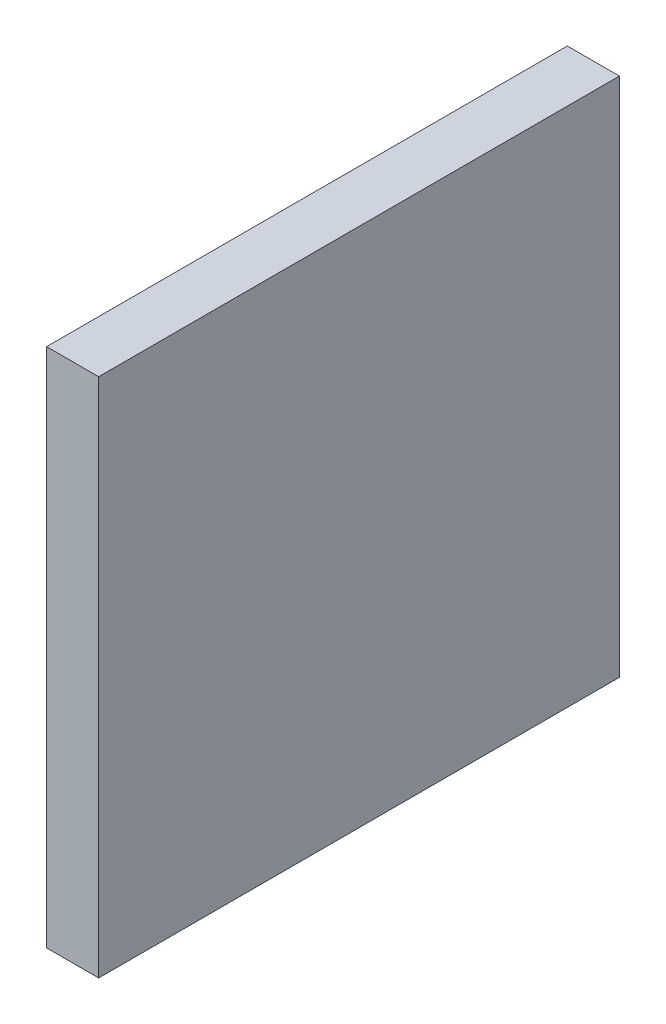
ISO-10303-21;
HEADER;
FILE_DESCRIPTION(('STEP AP214'),'2;1');
FILE_NAME('part.step','',(''),(''),'','','');
FILE_SCHEMA(('AUTOMOTIVE_DESIGN { 1 0 10303 214 1 1 1 1 }'));
ENDSEC;
DATA;
#1=APPLICATION_CONTEXT('core data for automotive mechanical design processes');
#2=APPLICATION_PROTOCOL_DEFINITION('international standard','automotive_design',2000,#1);
#3=PRODUCT_CONTEXT('',#1,'mechanical');
#4=PRODUCT('Part','Part','',(#3));
#5=PRODUCT_RELATED_PRODUCT_CATEGORY('part','',(#4));
#6=PRODUCT_DEFINITION_FORMATION('','',#4);
#7=PRODUCT_DEFINITION_CONTEXT('part definition',#1,'design');
#8=PRODUCT_DEFINITION('design','',#6,#7);
#9=PRODUCT_DEFINITION_SHAPE('','',#8);
#10=(LENGTH_UNIT() NAMED_UNIT(*) SI_UNIT(.MILLI.,.METRE.));
#11=(NAMED_UNIT(*) PLANE_ANGLE_UNIT() SI_UNIT($,.RADIAN.));
#12=(NAMED_UNIT(*) SI_UNIT($,.STERADIAN.) SOLID_ANGLE_UNIT());
#13=UNCERTAINTY_MEASURE_WITH_UNIT(LENGTH_MEASURE(1.E-05),#10,'distance_accuracy_value','');
#14=(GEOMETRIC_REPRESENTATION_CONTEXT(3) GLOBAL_UNCERTAINTY_ASSIGNED_CONTEXT((#13)) GLOBAL_UNIT_ASSIGNED_CONTEXT((#10,
#11,#12)) REPRESENTATION_CONTEXT('',''));
#15=CARTESIAN_POINT('',(0.,0.,0.));
#16=DIRECTION('',(0.,0.,1.));
#17=DIRECTION('',(1.,0.,0.));
#18=AXIS2_PLACEMENT_3D('',#15,#16,#17);
#19=CARTESIAN_POINT('',(5.,-25.,-25.));
#20=DIRECTION('',(0.,0.,1.));
#21=DIRECTION('',(1.,0.,0.));
#22=AXIS2_PLACEMENT_3D('',#19,#20,#21);
#23=PLANE('',#22);
#24=DIRECTION('',(0.,1.,0.));
#25=VECTOR('',#24,1.);
#26=CARTESIAN_POINT('',(0.,-25.,-25.));
#27=LINE('',#26,#25);
#28=CARTESIAN_POINT('',(0.,-25.,-25.));
#29=VERTEX_POINT('',#28);
#30=CARTESIAN_POINT('',(0.,25.,-25.));
#31=VERTEX_POINT('',#30);
#32=EDGE_CURVE('E113',#29,#31,#27,.T.);
#33=ORIENTED_EDGE('',*,*,#32,.T.);
#34=DIRECTION('',(-1.,0.,0.));
#35=VECTOR('',#34,1.);
#36=CARTESIAN_POINT('',(5.,25.,-25.));
#37=LINE('',#36,#35);
#38=CARTESIAN_POINT('',(5.,25.,-25.));
#39=VERTEX_POINT('',#38);
#40=EDGE_CURVE('E11',#39,#31,#37,.T.);
#41=ORIENTED_EDGE('',*,*,#40,.F.);
#42=DIRECTION('',(0.,1.,0.));
#43=VECTOR('',#42,1.);
#44=CARTESIAN_POINT('',(5.,-25.,-25.));
#45=LINE('',#44,#43);
#46=CARTESIAN_POINT('',(5.,-25.,-25.));
#47=VERTEX_POINT('',#46);
#48=EDGE_CURVE('E97',#47,#39,#45,.T.);
#49=ORIENTED_EDGE('',*,*,#48,.F.);
#50=DIRECTION('',(-1.,0.,0.));
#51=VECTOR('',#50,1.);
#52=CARTESIAN_POINT('',(5.,-25.,-25.));
#53=LINE('',#52,#51);
#54=EDGE_CURVE('E109',#47,#29,#53,.T.);
#55=ORIENTED_EDGE('',*,*,#54,.T.);
#56=EDGE_LOOP('',(#33,#41,#49,#55));
#57=FACE_BOUND('',#56,.T.);
#58=ADVANCED_FACE('F45',(#57),#23,.F.);
#59=CARTESIAN_POINT('',(5.,25.,25.));
#60=DIRECTION('',(0.,-1.,0.));
#61=DIRECTION('',(0.,0.,-1.));
#62=AXIS2_PLACEMENT_3D('',#59,#60,#61);
#63=PLANE('',#62);
#64=DIRECTION('',(0.,0.,1.));
#65=VECTOR('',#64,1.);
#66=CARTESIAN_POINT('',(0.,25.,25.));
#67=LINE('',#66,#65);
#68=CARTESIAN_POINT('',(0.,25.,25.));
#69=VERTEX_POINT('',#68);
#70=EDGE_CURVE('E102',#31,#69,#67,.T.);
#71=ORIENTED_EDGE('',*,*,#70,.T.);
#72=DIRECTION('',(-1.,0.,0.));
#73=VECTOR('',#72,1.);
#74=CARTESIAN_POINT('',(5.,25.,25.));
#75=LINE('',#74,#73);
#76=CARTESIAN_POINT('',(5.,25.,25.));
#77=VERTEX_POINT('',#76);
#78=EDGE_CURVE('E54',#77,#69,#75,.T.);
#79=ORIENTED_EDGE('',*,*,#78,.F.);
#80=DIRECTION('',(0.,0.,1.));
#81=VECTOR('',#80,1.);
#82=CARTESIAN_POINT('',(5.,25.,25.));
#83=LINE('',#82,#81);
#84=EDGE_CURVE('E92',#39,#77,#83,.T.);
#85=ORIENTED_EDGE('',*,*,#84,.F.);
#86=ORIENTED_EDGE('',*,*,#40,.T.);
#87=EDGE_LOOP('',(#71,#79,#85,#86));
#88=FACE_BOUND('',#87,.T.);
#89=ADVANCED_FACE('F101',(#88),#63,.F.);
#90=CARTESIAN_POINT('',(5.,-25.,25.));
#91=DIRECTION('',(0.,0.,-1.));
#92=DIRECTION('',(-1.,0.,0.));
#93=AXIS2_PLACEMENT_3D('',#90,#91,#92);
#94=PLANE('',#93);
#95=DIRECTION('',(0.,-1.,0.));
#96=VECTOR('',#95,1.);
#97=CARTESIAN_POINT('',(0.,-25.,25.));
#98=LINE('',#97,#96);
#99=CARTESIAN_POINT('',(0.,-25.,25.));
#100=VERTEX_POINT('',#99);
#101=EDGE_CURVE('E79',#69,#100,#98,.T.);
#102=ORIENTED_EDGE('',*,*,#101,.T.);
#103=DIRECTION('',(-1.,0.,0.));
#104=VECTOR('',#103,1.);
#105=CARTESIAN_POINT('',(5.,-25.,25.));
#106=LINE('',#105,#104);
#107=CARTESIAN_POINT('',(5.,-25.,25.));
#108=VERTEX_POINT('',#107);
#109=EDGE_CURVE('E104',#108,#100,#106,.T.);
#110=ORIENTED_EDGE('',*,*,#109,.F.);
#111=DIRECTION('',(0.,-1.,0.));
#112=VECTOR('',#111,1.);
#113=CARTESIAN_POINT('',(5.,-25.,25.));
#114=LINE('',#113,#112);
#115=EDGE_CURVE('E95',#77,#108,#114,.T.);
#116=ORIENTED_EDGE('',*,*,#115,.F.);
#117=ORIENTED_EDGE('',*,*,#78,.T.);
#118=EDGE_LOOP('',(#102,#110,#116,#117));
#119=FACE_BOUND('',#118,.T.);
#120=ADVANCED_FACE('F105',(#119),#94,.F.);
#121=CARTESIAN_POINT('',(5.,-25.,25.));
#122=DIRECTION('',(0.,1.,0.));
#123=DIRECTION('',(0.,0.,1.));
#124=AXIS2_PLACEMENT_3D('',#121,#122,#123);
#125=PLANE('',#124);
#126=DIRECTION('',(0.,0.,-1.));
#127=VECTOR('',#126,1.);
#128=CARTESIAN_POINT('',(0.,-25.,25.));
#129=LINE('',#128,#127);
#130=EDGE_CURVE('E85',#100,#29,#129,.T.);
#131=ORIENTED_EDGE('',*,*,#130,.T.);
#132=ORIENTED_EDGE('',*,*,#54,.F.);
#133=DIRECTION('',(0.,0.,-1.));
#134=VECTOR('',#133,1.);
#135=CARTESIAN_POINT('',(5.,-25.,25.));
#136=LINE('',#135,#134);
#137=EDGE_CURVE('E62',#108,#47,#136,.T.);
#138=ORIENTED_EDGE('',*,*,#137,.F.);
#139=ORIENTED_EDGE('',*,*,#109,.T.);
#140=EDGE_LOOP('',(#131,#132,#138,#139));
#141=FACE_BOUND('',#140,.T.);
#142=ADVANCED_FACE('F126',(#141),#125,.F.);
#143=CARTESIAN_POINT('',(5.,0.,0.));
#144=DIRECTION('',(-1.,0.,0.));
#145=DIRECTION('',(0.,0.,1.));
#146=AXIS2_PLACEMENT_3D('',#143,#144,#145);
#147=PLANE('',#146);
#148=ORIENTED_EDGE('',*,*,#48,.T.);
#149=ORIENTED_EDGE('',*,*,#84,.T.);
#150=ORIENTED_EDGE('',*,*,#115,.T.);
#151=ORIENTED_EDGE('',*,*,#137,.T.);
#152=EDGE_LOOP('',(#148,#149,#150,#151));
#153=FACE_BOUND('',#152,.T.);
#154=ADVANCED_FACE('F93',(#153),#147,.F.);
#155=CARTESIAN_POINT('',(0.,0.,0.));
#156=DIRECTION('',(-1.,0.,0.));
#157=DIRECTION('',(0.,0.,1.));
#158=AXIS2_PLACEMENT_3D('',#155,#156,#157);
#159=PLANE('',#158);
#160=ORIENTED_EDGE('',*,*,#32,.F.);
#161=ORIENTED_EDGE('',*,*,#130,.F.);
#162=ORIENTED_EDGE('',*,*,#101,.F.);
#163=ORIENTED_EDGE('',*,*,#70,.F.);
#164=EDGE_LOOP('',(#160,#161,#162,#163));
#165=FACE_BOUND('',#164,.T.);
#166=ADVANCED_FACE('F129',(#165),#159,.T.);
#167=CLOSED_SHELL('',(#58,#89,#120,#142,#154,#166));
#168=MANIFOLD_SOLID_BREP('B2',#167);
#169=ADVANCED_BREP_SHAPE_REPRESENTATION('',(#18,#168),#14);
#170=SHAPE_DEFINITION_REPRESENTATION(#9,#169);
ENDSEC;
END-ISO-10303-21;
